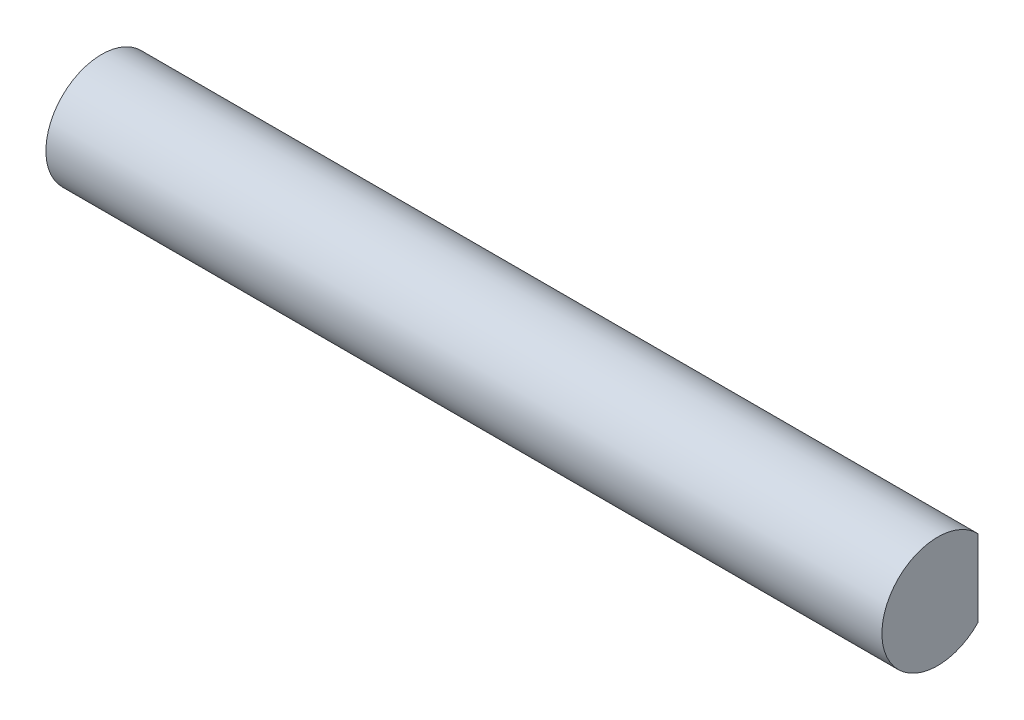
ISO-10303-21;
HEADER;
FILE_DESCRIPTION(('STEP AP214'),'2;1');
FILE_NAME('part.step','',(''),(''),'','','');
FILE_SCHEMA(('AUTOMOTIVE_DESIGN { 1 0 10303 214 1 1 1 1 }'));
ENDSEC;
DATA;
#1=APPLICATION_CONTEXT('core data for automotive mechanical design processes');
#2=APPLICATION_PROTOCOL_DEFINITION('international standard','automotive_design',2000,#1);
#3=PRODUCT_CONTEXT('',#1,'mechanical');
#4=PRODUCT('Part','Part','',(#3));
#5=PRODUCT_RELATED_PRODUCT_CATEGORY('part','',(#4));
#6=PRODUCT_DEFINITION_FORMATION('','',#4);
#7=PRODUCT_DEFINITION_CONTEXT('part definition',#1,'design');
#8=PRODUCT_DEFINITION('design','',#6,#7);
#9=PRODUCT_DEFINITION_SHAPE('','',#8);
#10=(LENGTH_UNIT() NAMED_UNIT(*) SI_UNIT(.MILLI.,.METRE.));
#11=(NAMED_UNIT(*) PLANE_ANGLE_UNIT() SI_UNIT($,.RADIAN.));
#12=(NAMED_UNIT(*) SI_UNIT($,.STERADIAN.) SOLID_ANGLE_UNIT());
#13=UNCERTAINTY_MEASURE_WITH_UNIT(LENGTH_MEASURE(1.E-05),#10,'distance_accuracy_value','');
#14=(GEOMETRIC_REPRESENTATION_CONTEXT(3) GLOBAL_UNCERTAINTY_ASSIGNED_CONTEXT((#13)) GLOBAL_UNIT_ASSIGNED_CONTEXT((#10,
#11,#12)) REPRESENTATION_CONTEXT('',''));
#15=CARTESIAN_POINT('',(0.,0.,0.));
#16=DIRECTION('',(0.,0.,1.));
#17=DIRECTION('',(1.,0.,0.));
#18=AXIS2_PLACEMENT_3D('',#15,#16,#17);
#19=CARTESIAN_POINT('',(-150.,7.73094010767585,1.00525588832597));
#20=DIRECTION('',(0.,0.866025403784436,0.500000000000004));
#21=DIRECTION('',(0.,-0.500000000000004,0.866025403784436));
#22=AXIS2_PLACEMENT_3D('',#19,#20,#21);
#23=PLANE('',#22);
#24=DIRECTION('',(0.,0.500000000000004,-0.866025403784436));
#25=VECTOR('',#24,1.);
#26=CARTESIAN_POINT('',(-0.799999999999995,7.73094010767585,1.00525588832597));
#27=LINE('',#26,#25);
#28=CARTESIAN_POINT('',(-0.799999999999995,5.482308546376,4.9000000000002));
#29=VERTEX_POINT('',#28);
#30=CARTESIAN_POINT('',(-0.799999999999995,7.73094010767585,1.00525588832597));
#31=VERTEX_POINT('',#30);
#32=EDGE_CURVE('E209',#29,#31,#27,.T.);
#33=ORIENTED_EDGE('',*,*,#32,.F.);
#34=DIRECTION('',(1.,0.,0.));
#35=VECTOR('',#34,1.);
#36=CARTESIAN_POINT('',(-150.,5.482308546376,4.9000000000002));
#37=LINE('',#36,#35);
#38=CARTESIAN_POINT('',(-145.,5.482308546376,4.9000000000002));
#39=VERTEX_POINT('',#38);
#40=EDGE_CURVE('E196',#39,#29,#37,.T.);
#41=ORIENTED_EDGE('',*,*,#40,.F.);
#42=DIRECTION('',(0.,-0.500000000000004,0.866025403784436));
#43=VECTOR('',#42,1.);
#44=CARTESIAN_POINT('',(-145.,7.73094010767585,1.00525588832597));
#45=LINE('',#44,#43);
#46=CARTESIAN_POINT('',(-145.,7.73094010767585,1.00525588832597));
#47=VERTEX_POINT('',#46);
#48=EDGE_CURVE('E206',#47,#39,#45,.T.);
#49=ORIENTED_EDGE('',*,*,#48,.F.);
#50=DIRECTION('',(1.,0.,0.));
#51=VECTOR('',#50,1.);
#52=CARTESIAN_POINT('',(-150.,7.73094010767585,1.00525588832597));
#53=LINE('',#52,#51);
#54=EDGE_CURVE('E210',#47,#31,#53,.T.);
#55=ORIENTED_EDGE('',*,*,#54,.T.);
#56=EDGE_LOOP('',(#33,#41,#49,#55));
#57=FACE_BOUND('',#56,.T.);
#58=ADVANCED_FACE('F33',(#57),#23,.F.);
#59=CARTESIAN_POINT('',(-150.,6.57320508075688,-0.999999999999804));
#60=DIRECTION('',(0.,0.86602540378444,-0.499999999999998));
#61=DIRECTION('',(0.,0.499999999999998,0.86602540378444));
#62=AXIS2_PLACEMENT_3D('',#59,#60,#61);
#63=PLANE('',#62);
#64=DIRECTION('',(0.,-0.499999999999998,-0.86602540378444));
#65=VECTOR('',#64,1.);
#66=CARTESIAN_POINT('',(-0.799999999999995,6.57320508075688,-0.999999999999804));
#67=LINE('',#66,#65);
#68=CARTESIAN_POINT('',(-0.799999999999995,6.57320508075688,-0.999999999999804));
#69=VERTEX_POINT('',#68);
#70=EDGE_CURVE('E48',#31,#69,#67,.T.);
#71=ORIENTED_EDGE('',*,*,#70,.F.);
#72=ORIENTED_EDGE('',*,*,#54,.F.);
#73=DIRECTION('',(0.,0.499999999999998,0.86602540378444));
#74=VECTOR('',#73,1.);
#75=CARTESIAN_POINT('',(-145.,6.57320508075688,-0.999999999999804));
#76=LINE('',#75,#74);
#77=CARTESIAN_POINT('',(-145.,6.57320508075688,-0.999999999999804));
#78=VERTEX_POINT('',#77);
#79=EDGE_CURVE('E349',#78,#47,#76,.T.);
#80=ORIENTED_EDGE('',*,*,#79,.F.);
#81=DIRECTION('',(1.,0.,0.));
#82=VECTOR('',#81,1.);
#83=CARTESIAN_POINT('',(-150.,6.57320508075688,-0.999999999999804));
#84=LINE('',#83,#82);
#85=EDGE_CURVE('E354',#78,#69,#84,.T.);
#86=ORIENTED_EDGE('',*,*,#85,.T.);
#87=EDGE_LOOP('',(#71,#72,#80,#86));
#88=FACE_BOUND('',#87,.T.);
#89=ADVANCED_FACE('F400',(#88),#63,.F.);
#90=CARTESIAN_POINT('',(-150.,-6.57320508075689,-0.999999999999804));
#91=DIRECTION('',(0.,0.,-1.));
#92=DIRECTION('',(-1.,0.,0.));
#93=AXIS2_PLACEMENT_3D('',#90,#91,#92);
#94=PLANE('',#93);
#95=DIRECTION('',(0.,1.,0.));
#96=VECTOR('',#95,1.);
#97=CARTESIAN_POINT('',(-50.5333333333333,-6.09999999999875,-0.999999999999805));
#98=LINE('',#97,#96);
#99=CARTESIAN_POINT('',(-50.5333333333333,-6.09999999999859,-0.999999999999801));
#100=VERTEX_POINT('',#99);
#101=CARTESIAN_POINT('',(-50.5333333333333,6.09999999999932,-0.999999999999801));
#102=VERTEX_POINT('',#101);
#103=EDGE_CURVE('E272',#100,#102,#98,.T.);
#104=ORIENTED_EDGE('',*,*,#103,.F.);
#105=DIRECTION('',(1.,0.,0.));
#106=VECTOR('',#105,1.);
#107=CARTESIAN_POINT('',(-50.5333333333333,-6.09999999999859,-0.999999999999805));
#108=LINE('',#107,#106);
#109=CARTESIAN_POINT('',(-99.4666666666668,-6.09999999999875,-0.999999999999805));
#110=VERTEX_POINT('',#109);
#111=EDGE_CURVE('E257',#110,#100,#108,.T.);
#112=ORIENTED_EDGE('',*,*,#111,.F.);
#113=DIRECTION('',(0.,-1.,0.));
#114=VECTOR('',#113,1.);
#115=CARTESIAN_POINT('',(-99.4666666666668,-6.09999999999875,-0.999999999999805));
#116=LINE('',#115,#114);
#117=CARTESIAN_POINT('',(-99.4666666666668,6.09999999999941,-0.999999999999804));
#118=VERTEX_POINT('',#117);
#119=EDGE_CURVE('E254',#118,#110,#116,.T.);
#120=ORIENTED_EDGE('',*,*,#119,.F.);
#121=DIRECTION('',(-1.,0.,0.));
#122=VECTOR('',#121,1.);
#123=CARTESIAN_POINT('',(-50.5333333333333,6.09999999999932,-0.999999999999805));
#124=LINE('',#123,#122);
#125=EDGE_CURVE('E253',#102,#118,#124,.T.);
#126=ORIENTED_EDGE('',*,*,#125,.F.);
#127=EDGE_LOOP('',(#104,#112,#120,#126));
#128=FACE_BOUND('',#127,.T.);
#129=DIRECTION('',(0.,-1.,0.));
#130=VECTOR('',#129,1.);
#131=CARTESIAN_POINT('',(-0.799999999999995,-6.57320508075689,-0.999999999999804));
#132=LINE('',#131,#130);
#133=CARTESIAN_POINT('',(-0.800000000000002,6.10000000000002,-0.999999999999801));
#134=VERTEX_POINT('',#133);
#135=EDGE_CURVE('E56',#69,#134,#132,.T.);
#136=ORIENTED_EDGE('',*,*,#135,.F.);
#137=ORIENTED_EDGE('',*,*,#85,.F.);
#138=DIRECTION('',(0.,1.,0.));
#139=VECTOR('',#138,1.);
#140=CARTESIAN_POINT('',(-145.,-6.57320508075689,-0.999999999999804));
#141=LINE('',#140,#139);
#142=CARTESIAN_POINT('',(-145.,6.09999999999988,-0.999999999999805));
#143=VERTEX_POINT('',#142);
#144=EDGE_CURVE('E345',#143,#78,#141,.T.);
#145=ORIENTED_EDGE('',*,*,#144,.F.);
#146=DIRECTION('',(-1.,0.,0.));
#147=VECTOR('',#146,1.);
#148=CARTESIAN_POINT('',(-100.266666666667,6.09999999999967,-0.999999999999805));
#149=LINE('',#148,#147);
#150=CARTESIAN_POINT('',(-100.266666666667,6.09999999999967,-0.999999999999801));
#151=VERTEX_POINT('',#150);
#152=EDGE_CURVE('E285',#151,#143,#149,.T.);
#153=ORIENTED_EDGE('',*,*,#152,.F.);
#154=DIRECTION('',(0.,1.,0.));
#155=VECTOR('',#154,1.);
#156=CARTESIAN_POINT('',(-100.266666666667,-6.0999999999984,-0.999999999999805));
#157=LINE('',#156,#155);
#158=CARTESIAN_POINT('',(-100.266666666667,-6.09999999999825,-0.999999999999801));
#159=VERTEX_POINT('',#158);
#160=EDGE_CURVE('E288',#159,#151,#157,.T.);
#161=ORIENTED_EDGE('',*,*,#160,.F.);
#162=DIRECTION('',(1.,0.,0.));
#163=VECTOR('',#162,1.);
#164=CARTESIAN_POINT('',(-100.266666666667,-6.09999999999825,-0.999999999999805));
#165=LINE('',#164,#163);
#166=CARTESIAN_POINT('',(-145.,-6.09999999999803,-0.999999999999805));
#167=VERTEX_POINT('',#166);
#168=EDGE_CURVE('E303',#167,#159,#165,.T.);
#169=ORIENTED_EDGE('',*,*,#168,.F.);
#170=CARTESIAN_POINT('',(-145.,-6.57320508075689,-0.999999999999804));
#171=VERTEX_POINT('',#170);
#172=EDGE_CURVE('E346',#171,#167,#141,.T.);
#173=ORIENTED_EDGE('',*,*,#172,.F.);
#174=DIRECTION('',(1.,0.,0.));
#175=VECTOR('',#174,1.);
#176=CARTESIAN_POINT('',(-150.,-6.57320508075689,-0.999999999999804));
#177=LINE('',#176,#175);
#178=CARTESIAN_POINT('',(-0.799999999999995,-6.57320508075689,-0.999999999999804));
#179=VERTEX_POINT('',#178);
#180=EDGE_CURVE('E356',#171,#179,#177,.T.);
#181=ORIENTED_EDGE('',*,*,#180,.T.);
#182=CARTESIAN_POINT('',(-0.800000000000003,-6.09999999999999,-0.999999999999805));
#183=VERTEX_POINT('',#182);
#184=EDGE_CURVE('E483',#183,#179,#132,.T.);
#185=ORIENTED_EDGE('',*,*,#184,.F.);
#186=DIRECTION('',(1.,0.,0.));
#187=VECTOR('',#186,1.);
#188=CARTESIAN_POINT('',(-0.800000000000003,-6.09999999999999,-0.999999999999805));
#189=LINE('',#188,#187);
#190=CARTESIAN_POINT('',(-49.7333333333334,-6.09999999999893,-0.999999999999804));
#191=VERTEX_POINT('',#190);
#192=EDGE_CURVE('E224',#191,#183,#189,.T.);
#193=ORIENTED_EDGE('',*,*,#192,.F.);
#194=DIRECTION('',(0.,-1.,0.));
#195=VECTOR('',#194,1.);
#196=CARTESIAN_POINT('',(-49.7333333333334,-6.09999999999909,-0.999999999999805));
#197=LINE('',#196,#195);
#198=CARTESIAN_POINT('',(-49.7333333333334,6.09999999999898,-0.999999999999801));
#199=VERTEX_POINT('',#198);
#200=EDGE_CURVE('E242',#199,#191,#197,.T.);
#201=ORIENTED_EDGE('',*,*,#200,.F.);
#202=DIRECTION('',(-1.,0.,0.));
#203=VECTOR('',#202,1.);
#204=CARTESIAN_POINT('',(-0.800000000000002,6.10000000000002,-0.999999999999805));
#205=LINE('',#204,#203);
#206=EDGE_CURVE('E227',#134,#199,#205,.T.);
#207=ORIENTED_EDGE('',*,*,#206,.F.);
#208=EDGE_LOOP('',(#136,#137,#145,#153,#161,#169,#173,#181,#185,#193,#201,#207));
#209=FACE_BOUND('',#208,.T.);
#210=ADVANCED_FACE('F404',(#128,#209),#94,.F.);
#211=CARTESIAN_POINT('',(-150.,-7.73094010767585,1.00525588832597));
#212=DIRECTION('',(0.,-0.86602540378444,-0.499999999999998));
#213=DIRECTION('',(0.,0.499999999999998,-0.86602540378444));
#214=AXIS2_PLACEMENT_3D('',#211,#212,#213);
#215=PLANE('',#214);
#216=DIRECTION('',(0.,-0.499999999999998,0.86602540378444));
#217=VECTOR('',#216,1.);
#218=CARTESIAN_POINT('',(-0.799999999999995,-7.73094010767585,1.00525588832597));
#219=LINE('',#218,#217);
#220=CARTESIAN_POINT('',(-0.799999999999995,-7.73094010767585,1.00525588832597));
#221=VERTEX_POINT('',#220);
#222=EDGE_CURVE('E219',#179,#221,#219,.T.);
#223=ORIENTED_EDGE('',*,*,#222,.F.);
#224=ORIENTED_EDGE('',*,*,#180,.F.);
#225=DIRECTION('',(0.,0.499999999999998,-0.86602540378444));
#226=VECTOR('',#225,1.);
#227=CARTESIAN_POINT('',(-145.,-7.73094010767585,1.00525588832597));
#228=LINE('',#227,#226);
#229=CARTESIAN_POINT('',(-145.,-7.73094010767585,1.00525588832597));
#230=VERTEX_POINT('',#229);
#231=EDGE_CURVE('E343',#230,#171,#228,.T.);
#232=ORIENTED_EDGE('',*,*,#231,.F.);
#233=DIRECTION('',(1.,0.,0.));
#234=VECTOR('',#233,1.);
#235=CARTESIAN_POINT('',(-150.,-7.73094010767585,1.00525588832597));
#236=LINE('',#235,#234);
#237=EDGE_CURVE('E359',#230,#221,#236,.T.);
#238=ORIENTED_EDGE('',*,*,#237,.T.);
#239=EDGE_LOOP('',(#223,#224,#232,#238));
#240=FACE_BOUND('',#239,.T.);
#241=ADVANCED_FACE('F412',(#240),#215,.F.);
#242=CARTESIAN_POINT('',(-150.,-5.48230854637601,4.9000000000002));
#243=DIRECTION('',(0.,-0.866025403784436,0.500000000000004));
#244=DIRECTION('',(0.,-0.500000000000004,-0.866025403784436));
#245=AXIS2_PLACEMENT_3D('',#242,#243,#244);
#246=PLANE('',#245);
#247=DIRECTION('',(0.,0.500000000000004,0.866025403784436));
#248=VECTOR('',#247,1.);
#249=CARTESIAN_POINT('',(-0.799999999999995,-5.48230854637601,4.9000000000002));
#250=LINE('',#249,#248);
#251=CARTESIAN_POINT('',(-0.799999999999995,-5.48230854637601,4.9000000000002));
#252=VERTEX_POINT('',#251);
#253=EDGE_CURVE('E217',#221,#252,#250,.T.);
#254=ORIENTED_EDGE('',*,*,#253,.F.);
#255=ORIENTED_EDGE('',*,*,#237,.F.);
#256=DIRECTION('',(0.,-0.500000000000004,-0.866025403784436));
#257=VECTOR('',#256,1.);
#258=CARTESIAN_POINT('',(-145.,-5.48230854637601,4.9000000000002));
#259=LINE('',#258,#257);
#260=CARTESIAN_POINT('',(-145.,-5.48230854637601,4.9000000000002));
#261=VERTEX_POINT('',#260);
#262=EDGE_CURVE('E339',#261,#230,#259,.T.);
#263=ORIENTED_EDGE('',*,*,#262,.F.);
#264=DIRECTION('',(1.,0.,0.));
#265=VECTOR('',#264,1.);
#266=CARTESIAN_POINT('',(-150.,-5.48230854637601,4.9000000000002));
#267=LINE('',#266,#265);
#268=EDGE_CURVE('E205',#261,#252,#267,.T.);
#269=ORIENTED_EDGE('',*,*,#268,.T.);
#270=EDGE_LOOP('',(#254,#255,#263,#269));
#271=FACE_BOUND('',#270,.T.);
#272=ADVANCED_FACE('F409',(#271),#246,.F.);
#273=CARTESIAN_POINT('',(-150.,5.482308546376,4.9000000000002));
#274=DIRECTION('',(0.,0.,1.));
#275=DIRECTION('',(1.,0.,0.));
#276=AXIS2_PLACEMENT_3D('',#273,#274,#275);
#277=PLANE('',#276);
#278=DIRECTION('',(0.,1.,0.));
#279=VECTOR('',#278,1.);
#280=CARTESIAN_POINT('',(-0.799999999999995,5.482308546376,4.9000000000002));
#281=LINE('',#280,#279);
#282=EDGE_CURVE('E201',#252,#29,#281,.T.);
#283=ORIENTED_EDGE('',*,*,#282,.F.);
#284=ORIENTED_EDGE('',*,*,#268,.F.);
#285=DIRECTION('',(0.,-1.,0.));
#286=VECTOR('',#285,1.);
#287=CARTESIAN_POINT('',(-145.,5.482308546376,4.9000000000002));
#288=LINE('',#287,#286);
#289=EDGE_CURVE('E11',#39,#261,#288,.T.);
#290=ORIENTED_EDGE('',*,*,#289,.F.);
#291=ORIENTED_EDGE('',*,*,#40,.T.);
#292=EDGE_LOOP('',(#283,#284,#290,#291));
#293=FACE_BOUND('',#292,.T.);
#294=ADVANCED_FACE('F198',(#293),#277,.F.);
#295=CARTESIAN_POINT('',(-150.,0.,1.95590071916385E-13));
#296=DIRECTION('',(1.,0.,0.));
#297=DIRECTION('',(0.,0.,-1.));
#298=AXIS2_PLACEMENT_3D('',#295,#296,#297);
#299=CYLINDRICAL_SURFACE('',#298,10.);
#300=CARTESIAN_POINT('',(0.,0.,1.95590071916385E-13));
#301=DIRECTION('',(1.,0.,0.));
#302=DIRECTION('',(0.,0.,-1.));
#303=AXIS2_PLACEMENT_3D('',#300,#301,#302);
#304=CIRCLE('',#303,10.);
#305=CARTESIAN_POINT('',(0.,6.9000000000001,-7.23809367167873));
#306=VERTEX_POINT('',#305);
#307=CARTESIAN_POINT('',(0.,-6.8999999999999,-7.23809367167893));
#308=VERTEX_POINT('',#307);
#309=EDGE_CURVE('E353',#306,#308,#304,.T.);
#310=ORIENTED_EDGE('',*,*,#309,.F.);
#311=DIRECTION('',(1.,0.,0.));
#312=VECTOR('',#311,1.);
#313=CARTESIAN_POINT('',(-150.,6.9000000000001,-7.23809367167873));
#314=LINE('',#313,#312);
#315=CARTESIAN_POINT('',(-150.,6.9000000000001,-7.23809367167873));
#316=VERTEX_POINT('',#315);
#317=EDGE_CURVE('E41',#316,#306,#314,.T.);
#318=ORIENTED_EDGE('',*,*,#317,.F.);
#319=CARTESIAN_POINT('',(-150.,0.,1.95590071916385E-13));
#320=DIRECTION('',(1.,0.,0.));
#321=DIRECTION('',(0.,0.,-1.));
#322=AXIS2_PLACEMENT_3D('',#319,#320,#321);
#323=CIRCLE('',#322,10.);
#324=CARTESIAN_POINT('',(-150.,-6.8999999999999,-7.23809367167893));
#325=VERTEX_POINT('',#324);
#326=EDGE_CURVE('E363',#316,#325,#323,.T.);
#327=ORIENTED_EDGE('',*,*,#326,.T.);
#328=DIRECTION('',(1.,0.,0.));
#329=VECTOR('',#328,1.);
#330=CARTESIAN_POINT('',(-150.,-6.8999999999999,-7.23809367167893));
#331=LINE('',#330,#329);
#332=EDGE_CURVE('E370',#325,#308,#331,.T.);
#333=ORIENTED_EDGE('',*,*,#332,.T.);
#334=EDGE_LOOP('',(#310,#318,#327,#333));
#335=FACE_BOUND('',#334,.T.);
#336=ADVANCED_FACE('F35',(#335),#299,.T.);
#337=CARTESIAN_POINT('',(-150.,-6.8999999999999,-7.23809367167893));
#338=DIRECTION('',(0.,0.,-1.));
#339=DIRECTION('',(0.,1.,0.));
#340=AXIS2_PLACEMENT_3D('',#337,#338,#339);
#341=PLANE('',#340);
#342=DIRECTION('',(0.,-1.,0.));
#343=VECTOR('',#342,1.);
#344=CARTESIAN_POINT('',(-0.800000000000003,-6.0999999999999,-7.23809367167892));
#345=LINE('',#344,#343);
#346=CARTESIAN_POINT('',(-0.800000000000002,6.10000000000011,-7.23809367167874));
#347=VERTEX_POINT('',#346);
#348=CARTESIAN_POINT('',(-0.799999999999995,-6.0999999999999,-7.23809367167892));
#349=VERTEX_POINT('',#348);
#350=EDGE_CURVE('E237',#347,#349,#345,.T.);
#351=ORIENTED_EDGE('',*,*,#350,.F.);
#352=DIRECTION('',(1.,0.,0.));
#353=VECTOR('',#352,1.);
#354=CARTESIAN_POINT('',(-0.800000000000002,6.10000000000011,-7.23809367167874));
#355=LINE('',#354,#353);
#356=CARTESIAN_POINT('',(-49.7333333333334,6.09999999999907,-7.23809367167874));
#357=VERTEX_POINT('',#356);
#358=EDGE_CURVE('E228',#357,#347,#355,.T.);
#359=ORIENTED_EDGE('',*,*,#358,.F.);
#360=DIRECTION('',(0.,1.,0.));
#361=VECTOR('',#360,1.);
#362=CARTESIAN_POINT('',(-49.7333333333334,-6.09999999999884,-7.23809367167892));
#363=LINE('',#362,#361);
#364=CARTESIAN_POINT('',(-49.7333333333334,-6.09999999999884,-7.23809367167892));
#365=VERTEX_POINT('',#364);
#366=EDGE_CURVE('E231',#365,#357,#363,.T.);
#367=ORIENTED_EDGE('',*,*,#366,.F.);
#368=DIRECTION('',(-1.,0.,0.));
#369=VECTOR('',#368,1.);
#370=CARTESIAN_POINT('',(-0.800000000000003,-6.0999999999999,-7.23809367167892));
#371=LINE('',#370,#369);
#372=EDGE_CURVE('E234',#349,#365,#371,.T.);
#373=ORIENTED_EDGE('',*,*,#372,.F.);
#374=EDGE_LOOP('',(#351,#359,#367,#373));
#375=FACE_BOUND('',#374,.T.);
#376=ORIENTED_EDGE('',*,*,#317,.T.);
#377=DIRECTION('',(0.,1.,0.));
#378=VECTOR('',#377,1.);
#379=CARTESIAN_POINT('',(0.,-6.8999999999999,-7.23809367167893));
#380=LINE('',#379,#378);
#381=EDGE_CURVE('E367',#308,#306,#380,.T.);
#382=ORIENTED_EDGE('',*,*,#381,.F.);
#383=ORIENTED_EDGE('',*,*,#332,.F.);
#384=DIRECTION('',(0.,1.,0.));
#385=VECTOR('',#384,1.);
#386=CARTESIAN_POINT('',(-150.,-6.8999999999999,-7.23809367167893));
#387=LINE('',#386,#385);
#388=EDGE_CURVE('E366',#325,#316,#387,.T.);
#389=ORIENTED_EDGE('',*,*,#388,.T.);
#390=EDGE_LOOP('',(#376,#382,#383,#389));
#391=FACE_BOUND('',#390,.T.);
#392=DIRECTION('',(-1.,0.,0.));
#393=VECTOR('',#392,1.);
#394=CARTESIAN_POINT('',(-50.5333333333333,-6.0999999999985,-7.23809367167892));
#395=LINE('',#394,#393);
#396=CARTESIAN_POINT('',(-50.5333333333333,-6.0999999999985,-7.23809367167892));
#397=VERTEX_POINT('',#396);
#398=CARTESIAN_POINT('',(-99.4666666666668,-6.09999999999859,-7.23809367167892));
#399=VERTEX_POINT('',#398);
#400=EDGE_CURVE('E267',#397,#399,#395,.T.);
#401=ORIENTED_EDGE('',*,*,#400,.F.);
#402=DIRECTION('',(0.,-1.,0.));
#403=VECTOR('',#402,1.);
#404=CARTESIAN_POINT('',(-50.5333333333333,-6.0999999999985,-7.23809367167892));
#405=LINE('',#404,#403);
#406=CARTESIAN_POINT('',(-50.5333333333333,6.09999999999941,-7.23809367167874));
#407=VERTEX_POINT('',#406);
#408=EDGE_CURVE('E258',#407,#397,#405,.T.);
#409=ORIENTED_EDGE('',*,*,#408,.F.);
#410=DIRECTION('',(1.,0.,0.));
#411=VECTOR('',#410,1.);
#412=CARTESIAN_POINT('',(-50.5333333333333,6.09999999999941,-7.23809367167874));
#413=LINE('',#412,#411);
#414=CARTESIAN_POINT('',(-99.4666666666668,6.09999999999941,-7.23809367167874));
#415=VERTEX_POINT('',#414);
#416=EDGE_CURVE('E261',#415,#407,#413,.T.);
#417=ORIENTED_EDGE('',*,*,#416,.F.);
#418=DIRECTION('',(0.,1.,0.));
#419=VECTOR('',#418,1.);
#420=CARTESIAN_POINT('',(-99.4666666666668,-6.0999999999985,-7.23809367167892));
#421=LINE('',#420,#419);
#422=EDGE_CURVE('E264',#399,#415,#421,.T.);
#423=ORIENTED_EDGE('',*,*,#422,.F.);
#424=EDGE_LOOP('',(#401,#409,#417,#423));
#425=FACE_BOUND('',#424,.T.);
#426=DIRECTION('',(0.,1.,0.));
#427=VECTOR('',#426,1.);
#428=CARTESIAN_POINT('',(-149.2,-6.09999999999792,-7.23809367167892));
#429=LINE('',#428,#427);
#430=CARTESIAN_POINT('',(-149.2,-6.09999999999792,-7.23809367167892));
#431=VERTEX_POINT('',#430);
#432=CARTESIAN_POINT('',(-149.2,6.09999999999999,-7.23809367167874));
#433=VERTEX_POINT('',#432);
#434=EDGE_CURVE('E298',#431,#433,#429,.T.);
#435=ORIENTED_EDGE('',*,*,#434,.F.);
#436=DIRECTION('',(-1.,0.,0.));
#437=VECTOR('',#436,1.);
#438=CARTESIAN_POINT('',(-100.266666666667,-6.09999999999816,-7.23809367167892));
#439=LINE('',#438,#437);
#440=CARTESIAN_POINT('',(-100.266666666667,-6.09999999999816,-7.23809367167892));
#441=VERTEX_POINT('',#440);
#442=EDGE_CURVE('E287',#441,#431,#439,.T.);
#443=ORIENTED_EDGE('',*,*,#442,.F.);
#444=DIRECTION('',(0.,-1.,0.));
#445=VECTOR('',#444,1.);
#446=CARTESIAN_POINT('',(-100.266666666667,-6.09999999999816,-7.23809367167892));
#447=LINE('',#446,#445);
#448=CARTESIAN_POINT('',(-100.266666666667,6.09999999999976,-7.23809367167874));
#449=VERTEX_POINT('',#448);
#450=EDGE_CURVE('E292',#449,#441,#447,.T.);
#451=ORIENTED_EDGE('',*,*,#450,.F.);
#452=DIRECTION('',(1.,0.,0.));
#453=VECTOR('',#452,1.);
#454=CARTESIAN_POINT('',(-100.266666666667,6.09999999999976,-7.23809367167874));
#455=LINE('',#454,#453);
#456=EDGE_CURVE('E295',#433,#449,#455,.T.);
#457=ORIENTED_EDGE('',*,*,#456,.F.);
#458=EDGE_LOOP('',(#435,#443,#451,#457));
#459=FACE_BOUND('',#458,.T.);
#460=ADVANCED_FACE('F383',(#375,#391,#425,#459),#341,.T.);
#461=CARTESIAN_POINT('',(-150.,0.,1.95590071916385E-13));
#462=DIRECTION('',(1.,0.,0.));
#463=DIRECTION('',(0.,0.,-1.));
#464=AXIS2_PLACEMENT_3D('',#461,#462,#463);
#465=PLANE('',#464);
#466=DIRECTION('',(0.,-1.,0.));
#467=VECTOR('',#466,1.);
#468=CARTESIAN_POINT('',(-150.,-6.4873867884811,-6.23809367167893));
#469=LINE('',#468,#467);
#470=CARTESIAN_POINT('',(-150.,6.48738678848111,-6.23809367167893));
#471=VERTEX_POINT('',#470);
#472=CARTESIAN_POINT('',(-150.,-6.4873867884811,-6.23809367167893));
#473=VERTEX_POINT('',#472);
#474=EDGE_CURVE('E329',#471,#473,#469,.T.);
#475=ORIENTED_EDGE('',*,*,#474,.F.);
#476=CARTESIAN_POINT('',(-150.,0.,0.));
#477=DIRECTION('',(-1.,0.,0.));
#478=DIRECTION('',(0.,0.,1.));
#479=AXIS2_PLACEMENT_3D('',#476,#477,#478);
#480=CIRCLE('',#479,9.);
#481=EDGE_CURVE('E244',#473,#471,#480,.T.);
#482=ORIENTED_EDGE('',*,*,#481,.F.);
#483=EDGE_LOOP('',(#475,#482));
#484=FACE_BOUND('',#483,.T.);
#485=ORIENTED_EDGE('',*,*,#326,.F.);
#486=ORIENTED_EDGE('',*,*,#388,.F.);
#487=EDGE_LOOP('',(#485,#486));
#488=FACE_BOUND('',#487,.T.);
#489=ADVANCED_FACE('F386',(#484,#488),#465,.F.);
#490=CARTESIAN_POINT('',(0.,0.,1.95590071916385E-13));
#491=DIRECTION('',(1.,0.,0.));
#492=DIRECTION('',(0.,0.,-1.));
#493=AXIS2_PLACEMENT_3D('',#490,#491,#492);
#494=PLANE('',#493);
#495=ORIENTED_EDGE('',*,*,#309,.T.);
#496=ORIENTED_EDGE('',*,*,#381,.T.);
#497=EDGE_LOOP('',(#495,#496));
#498=FACE_BOUND('',#497,.T.);
#499=ADVANCED_FACE('F382',(#498),#494,.T.);
#500=CARTESIAN_POINT('',(-145.,0.,0.));
#501=DIRECTION('',(-1.,0.,0.));
#502=DIRECTION('',(0.,0.,1.));
#503=AXIS2_PLACEMENT_3D('',#500,#501,#502);
#504=PLANE('',#503);
#505=DIRECTION('',(0.,0.,1.));
#506=VECTOR('',#505,1.);
#507=CARTESIAN_POINT('',(-145.,6.09999999999972,10.0010000000004));
#508=LINE('',#507,#506);
#509=CARTESIAN_POINT('',(-145.,6.09999999999995,-6.23809367167893));
#510=VERTEX_POINT('',#509);
#511=EDGE_CURVE('E312',#510,#143,#508,.T.);
#512=ORIENTED_EDGE('',*,*,#511,.T.);
#513=ORIENTED_EDGE('',*,*,#144,.T.);
#514=ORIENTED_EDGE('',*,*,#79,.T.);
#515=ORIENTED_EDGE('',*,*,#48,.T.);
#516=ORIENTED_EDGE('',*,*,#289,.T.);
#517=ORIENTED_EDGE('',*,*,#262,.T.);
#518=ORIENTED_EDGE('',*,*,#231,.T.);
#519=ORIENTED_EDGE('',*,*,#172,.T.);
#520=DIRECTION('',(0.,0.,-1.));
#521=VECTOR('',#520,1.);
#522=CARTESIAN_POINT('',(-145.,-6.09999999999819,10.0010000000002));
#523=LINE('',#522,#521);
#524=CARTESIAN_POINT('',(-145.,-6.09999999999796,-6.23809367167893));
#525=VERTEX_POINT('',#524);
#526=EDGE_CURVE('E319',#167,#525,#523,.T.);
#527=ORIENTED_EDGE('',*,*,#526,.T.);
#528=DIRECTION('',(0.,-1.,0.));
#529=VECTOR('',#528,1.);
#530=CARTESIAN_POINT('',(-145.,-6.4873867884811,-6.23809367167893));
#531=LINE('',#530,#529);
#532=CARTESIAN_POINT('',(-145.,-6.4873867884811,-6.23809367167893));
#533=VERTEX_POINT('',#532);
#534=EDGE_CURVE('E328',#525,#533,#531,.T.);
#535=ORIENTED_EDGE('',*,*,#534,.T.);
#536=CARTESIAN_POINT('',(-145.,0.,0.));
#537=DIRECTION('',(-1.,0.,0.));
#538=DIRECTION('',(0.,0.,1.));
#539=AXIS2_PLACEMENT_3D('',#536,#537,#538);
#540=CIRCLE('',#539,9.);
#541=CARTESIAN_POINT('',(-145.,6.48738678848111,-6.23809367167893));
#542=VERTEX_POINT('',#541);
#543=EDGE_CURVE('E325',#533,#542,#540,.T.);
#544=ORIENTED_EDGE('',*,*,#543,.T.);
#545=EDGE_CURVE('E330',#542,#510,#531,.T.);
#546=ORIENTED_EDGE('',*,*,#545,.T.);
#547=EDGE_LOOP('',(#512,#513,#514,#515,#516,#517,#518,#519,#527,#535,#544,#546));
#548=FACE_BOUND('',#547,.T.);
#549=ADVANCED_FACE('F394',(#548),#504,.T.);
#550=CARTESIAN_POINT('',(-145.,0.,0.));
#551=DIRECTION('',(-1.,0.,0.));
#552=DIRECTION('',(0.,0.,1.));
#553=AXIS2_PLACEMENT_3D('',#550,#551,#552);
#554=CYLINDRICAL_SURFACE('',#553,9.);
#555=ORIENTED_EDGE('',*,*,#481,.T.);
#556=DIRECTION('',(-1.,0.,0.));
#557=VECTOR('',#556,1.);
#558=CARTESIAN_POINT('',(-145.,6.48738678848111,-6.23809367167893));
#559=LINE('',#558,#557);
#560=EDGE_CURVE('E333',#542,#471,#559,.T.);
#561=ORIENTED_EDGE('',*,*,#560,.F.);
#562=ORIENTED_EDGE('',*,*,#543,.F.);
#563=DIRECTION('',(-1.,0.,0.));
#564=VECTOR('',#563,1.);
#565=CARTESIAN_POINT('',(-145.,-6.4873867884811,-6.23809367167893));
#566=LINE('',#565,#564);
#567=EDGE_CURVE('E337',#533,#473,#566,.T.);
#568=ORIENTED_EDGE('',*,*,#567,.T.);
#569=EDGE_LOOP('',(#555,#561,#562,#568));
#570=FACE_BOUND('',#569,.T.);
#571=ADVANCED_FACE('F420',(#570),#554,.F.);
#572=CARTESIAN_POINT('',(-145.,-6.4873867884811,-6.23809367167893));
#573=DIRECTION('',(0.,0.,-1.));
#574=DIRECTION('',(0.,1.,0.));
#575=AXIS2_PLACEMENT_3D('',#572,#573,#574);
#576=PLANE('',#575);
#577=DIRECTION('',(0.,-1.,0.));
#578=VECTOR('',#577,1.);
#579=CARTESIAN_POINT('',(-149.2,-6.09999999999818,-6.23809367167893));
#580=LINE('',#579,#578);
#581=CARTESIAN_POINT('',(-149.2,6.09999999999997,-6.23809367167892));
#582=VERTEX_POINT('',#581);
#583=CARTESIAN_POINT('',(-149.2,-6.09999999999794,-6.23809367167893));
#584=VERTEX_POINT('',#583);
#585=EDGE_CURVE('E289',#582,#584,#580,.T.);
#586=ORIENTED_EDGE('',*,*,#585,.F.);
#587=DIRECTION('',(-1.,0.,0.));
#588=VECTOR('',#587,1.);
#589=CARTESIAN_POINT('',(-100.266666666667,6.09999999999974,-6.23809367167893));
#590=LINE('',#589,#588);
#591=EDGE_CURVE('E306',#510,#582,#590,.T.);
#592=ORIENTED_EDGE('',*,*,#591,.F.);
#593=ORIENTED_EDGE('',*,*,#545,.F.);
#594=ORIENTED_EDGE('',*,*,#560,.T.);
#595=ORIENTED_EDGE('',*,*,#474,.T.);
#596=ORIENTED_EDGE('',*,*,#567,.F.);
#597=ORIENTED_EDGE('',*,*,#534,.F.);
#598=DIRECTION('',(1.,0.,0.));
#599=VECTOR('',#598,1.);
#600=CARTESIAN_POINT('',(-100.266666666667,-6.09999999999817,-6.23809367167893));
#601=LINE('',#600,#599);
#602=EDGE_CURVE('E291',#584,#525,#601,.T.);
#603=ORIENTED_EDGE('',*,*,#602,.F.);
#604=EDGE_LOOP('',(#586,#592,#593,#594,#595,#596,#597,#603));
#605=FACE_BOUND('',#604,.T.);
#606=ADVANCED_FACE('F423',(#605),#576,.F.);
#607=CARTESIAN_POINT('',(-149.2,-6.09999999999817,10.0010000000002));
#608=DIRECTION('',(-1.,0.,0.));
#609=DIRECTION('',(0.,0.,1.));
#610=AXIS2_PLACEMENT_3D('',#607,#608,#609);
#611=PLANE('',#610);
#612=ORIENTED_EDGE('',*,*,#585,.T.);
#613=DIRECTION('',(0.,0.,-1.));
#614=VECTOR('',#613,1.);
#615=CARTESIAN_POINT('',(-149.2,-6.09999999999817,10.0010000000002));
#616=LINE('',#615,#614);
#617=EDGE_CURVE('E284',#584,#431,#616,.T.);
#618=ORIENTED_EDGE('',*,*,#617,.T.);
#619=ORIENTED_EDGE('',*,*,#434,.T.);
#620=DIRECTION('',(0.,0.,-1.));
#621=VECTOR('',#620,1.);
#622=CARTESIAN_POINT('',(-149.2,6.09999999999974,10.0010000000004));
#623=LINE('',#622,#621);
#624=EDGE_CURVE('E294',#582,#433,#623,.T.);
#625=ORIENTED_EDGE('',*,*,#624,.F.);
#626=EDGE_LOOP('',(#612,#618,#619,#625));
#627=FACE_BOUND('',#626,.T.);
#628=ADVANCED_FACE('F427',(#627),#611,.F.);
#629=CARTESIAN_POINT('',(-100.266666666667,6.09999999999951,10.0010000000004));
#630=DIRECTION('',(0.,1.,0.));
#631=DIRECTION('',(0.,0.,1.));
#632=AXIS2_PLACEMENT_3D('',#629,#630,#631);
#633=PLANE('',#632);
#634=ORIENTED_EDGE('',*,*,#152,.T.);
#635=ORIENTED_EDGE('',*,*,#511,.F.);
#636=ORIENTED_EDGE('',*,*,#591,.T.);
#637=ORIENTED_EDGE('',*,*,#624,.T.);
#638=ORIENTED_EDGE('',*,*,#456,.T.);
#639=DIRECTION('',(0.,0.,-1.));
#640=VECTOR('',#639,1.);
#641=CARTESIAN_POINT('',(-100.266666666667,6.09999999999951,10.0010000000004));
#642=LINE('',#641,#640);
#643=EDGE_CURVE('E316',#151,#449,#642,.T.);
#644=ORIENTED_EDGE('',*,*,#643,.F.);
#645=EDGE_LOOP('',(#634,#635,#636,#637,#638,#644));
#646=FACE_BOUND('',#645,.T.);
#647=ADVANCED_FACE('F434',(#646),#633,.F.);
#648=CARTESIAN_POINT('',(-100.266666666667,-6.0999999999984,10.0010000000002));
#649=DIRECTION('',(1.,0.,0.));
#650=DIRECTION('',(0.,0.,-1.));
#651=AXIS2_PLACEMENT_3D('',#648,#649,#650);
#652=PLANE('',#651);
#653=ORIENTED_EDGE('',*,*,#160,.T.);
#654=ORIENTED_EDGE('',*,*,#643,.T.);
#655=ORIENTED_EDGE('',*,*,#450,.T.);
#656=DIRECTION('',(0.,0.,-1.));
#657=VECTOR('',#656,1.);
#658=CARTESIAN_POINT('',(-100.266666666667,-6.0999999999984,10.0010000000002));
#659=LINE('',#658,#657);
#660=EDGE_CURVE('E315',#159,#441,#659,.T.);
#661=ORIENTED_EDGE('',*,*,#660,.F.);
#662=EDGE_LOOP('',(#653,#654,#655,#661));
#663=FACE_BOUND('',#662,.T.);
#664=ADVANCED_FACE('F438',(#663),#652,.F.);
#665=CARTESIAN_POINT('',(-100.266666666667,-6.0999999999984,10.0010000000002));
#666=DIRECTION('',(0.,-1.,0.));
#667=DIRECTION('',(0.,0.,-1.));
#668=AXIS2_PLACEMENT_3D('',#665,#666,#667);
#669=PLANE('',#668);
#670=ORIENTED_EDGE('',*,*,#168,.T.);
#671=ORIENTED_EDGE('',*,*,#660,.T.);
#672=ORIENTED_EDGE('',*,*,#442,.T.);
#673=ORIENTED_EDGE('',*,*,#617,.F.);
#674=ORIENTED_EDGE('',*,*,#602,.T.);
#675=ORIENTED_EDGE('',*,*,#526,.F.);
#676=EDGE_LOOP('',(#670,#671,#672,#673,#674,#675));
#677=FACE_BOUND('',#676,.T.);
#678=ADVANCED_FACE('F442',(#677),#669,.F.);
#679=CARTESIAN_POINT('',(-50.5333333333333,-6.09999999999875,10.0010000000002));
#680=DIRECTION('',(0.,-1.,0.));
#681=DIRECTION('',(0.,0.,-1.));
#682=AXIS2_PLACEMENT_3D('',#679,#680,#681);
#683=PLANE('',#682);
#684=ORIENTED_EDGE('',*,*,#111,.T.);
#685=DIRECTION('',(0.,0.,-1.));
#686=VECTOR('',#685,1.);
#687=CARTESIAN_POINT('',(-50.5333333333333,-6.09999999999875,10.0010000000002));
#688=LINE('',#687,#686);
#689=EDGE_CURVE('E276',#100,#397,#688,.T.);
#690=ORIENTED_EDGE('',*,*,#689,.T.);
#691=ORIENTED_EDGE('',*,*,#400,.T.);
#692=DIRECTION('',(0.,0.,-1.));
#693=VECTOR('',#692,1.);
#694=CARTESIAN_POINT('',(-99.4666666666668,-6.09999999999875,10.0010000000002));
#695=LINE('',#694,#693);
#696=EDGE_CURVE('E279',#110,#399,#695,.T.);
#697=ORIENTED_EDGE('',*,*,#696,.F.);
#698=EDGE_LOOP('',(#684,#690,#691,#697));
#699=FACE_BOUND('',#698,.T.);
#700=ADVANCED_FACE('F446',(#699),#683,.F.);
#701=CARTESIAN_POINT('',(-50.5333333333333,-6.09999999999875,10.0010000000002));
#702=DIRECTION('',(1.,0.,0.));
#703=DIRECTION('',(0.,0.,-1.));
#704=AXIS2_PLACEMENT_3D('',#701,#702,#703);
#705=PLANE('',#704);
#706=ORIENTED_EDGE('',*,*,#103,.T.);
#707=DIRECTION('',(0.,0.,-1.));
#708=VECTOR('',#707,1.);
#709=CARTESIAN_POINT('',(-50.5333333333333,6.09999999999916,10.0010000000004));
#710=LINE('',#709,#708);
#711=EDGE_CURVE('E278',#102,#407,#710,.T.);
#712=ORIENTED_EDGE('',*,*,#711,.T.);
#713=ORIENTED_EDGE('',*,*,#408,.T.);
#714=ORIENTED_EDGE('',*,*,#689,.F.);
#715=EDGE_LOOP('',(#706,#712,#713,#714));
#716=FACE_BOUND('',#715,.T.);
#717=ADVANCED_FACE('F450',(#716),#705,.F.);
#718=CARTESIAN_POINT('',(-50.5333333333333,6.09999999999916,10.0010000000004));
#719=DIRECTION('',(0.,1.,0.));
#720=DIRECTION('',(0.,0.,1.));
#721=AXIS2_PLACEMENT_3D('',#718,#719,#720);
#722=PLANE('',#721);
#723=ORIENTED_EDGE('',*,*,#125,.T.);
#724=DIRECTION('',(0.,0.,-1.));
#725=VECTOR('',#724,1.);
#726=CARTESIAN_POINT('',(-99.4666666666668,6.09999999999917,10.0010000000004));
#727=LINE('',#726,#725);
#728=EDGE_CURVE('E269',#118,#415,#727,.T.);
#729=ORIENTED_EDGE('',*,*,#728,.T.);
#730=ORIENTED_EDGE('',*,*,#416,.T.);
#731=ORIENTED_EDGE('',*,*,#711,.F.);
#732=EDGE_LOOP('',(#723,#729,#730,#731));
#733=FACE_BOUND('',#732,.T.);
#734=ADVANCED_FACE('F454',(#733),#722,.F.);
#735=CARTESIAN_POINT('',(-99.4666666666668,-6.09999999999875,10.0010000000002));
#736=DIRECTION('',(-1.,0.,0.));
#737=DIRECTION('',(0.,0.,1.));
#738=AXIS2_PLACEMENT_3D('',#735,#736,#737);
#739=PLANE('',#738);
#740=ORIENTED_EDGE('',*,*,#119,.T.);
#741=ORIENTED_EDGE('',*,*,#696,.T.);
#742=ORIENTED_EDGE('',*,*,#422,.T.);
#743=ORIENTED_EDGE('',*,*,#728,.F.);
#744=EDGE_LOOP('',(#740,#741,#742,#743));
#745=FACE_BOUND('',#744,.T.);
#746=ADVANCED_FACE('F458',(#745),#739,.F.);
#747=CARTESIAN_POINT('',(-0.800000000000003,-6.10000000000014,10.0010000000002));
#748=DIRECTION('',(1.,0.,0.));
#749=DIRECTION('',(0.,1.,0.));
#750=AXIS2_PLACEMENT_3D('',#747,#748,#749);
#751=PLANE('',#750);
#752=DIRECTION('',(0.,0.,-1.));
#753=VECTOR('',#752,1.);
#754=CARTESIAN_POINT('',(-0.800000000000003,-6.10000000000014,10.0010000000002));
#755=LINE('',#754,#753);
#756=EDGE_CURVE('E248',#183,#349,#755,.T.);
#757=ORIENTED_EDGE('',*,*,#756,.F.);
#758=ORIENTED_EDGE('',*,*,#184,.T.);
#759=ORIENTED_EDGE('',*,*,#222,.T.);
#760=ORIENTED_EDGE('',*,*,#253,.T.);
#761=ORIENTED_EDGE('',*,*,#282,.T.);
#762=ORIENTED_EDGE('',*,*,#32,.T.);
#763=ORIENTED_EDGE('',*,*,#70,.T.);
#764=ORIENTED_EDGE('',*,*,#135,.T.);
#765=DIRECTION('',(0.,0.,-1.));
#766=VECTOR('',#765,1.);
#767=CARTESIAN_POINT('',(-0.800000000000002,6.09999999999986,10.0010000000004));
#768=LINE('',#767,#766);
#769=EDGE_CURVE('E245',#134,#347,#768,.T.);
#770=ORIENTED_EDGE('',*,*,#769,.T.);
#771=ORIENTED_EDGE('',*,*,#350,.T.);
#772=EDGE_LOOP('',(#757,#758,#759,#760,#761,#762,#763,#764,#770,#771));
#773=FACE_BOUND('',#772,.T.);
#774=ADVANCED_FACE('F215',(#773),#751,.F.);
#775=CARTESIAN_POINT('',(-0.800000000000002,6.09999999999986,10.0010000000004));
#776=DIRECTION('',(0.,1.,0.));
#777=DIRECTION('',(-1.,0.,0.));
#778=AXIS2_PLACEMENT_3D('',#775,#776,#777);
#779=PLANE('',#778);
#780=ORIENTED_EDGE('',*,*,#206,.T.);
#781=DIRECTION('',(0.,0.,-1.));
#782=VECTOR('',#781,1.);
#783=CARTESIAN_POINT('',(-49.7333333333334,6.09999999999882,10.0010000000004));
#784=LINE('',#783,#782);
#785=EDGE_CURVE('E247',#199,#357,#784,.T.);
#786=ORIENTED_EDGE('',*,*,#785,.T.);
#787=ORIENTED_EDGE('',*,*,#358,.T.);
#788=ORIENTED_EDGE('',*,*,#769,.F.);
#789=EDGE_LOOP('',(#780,#786,#787,#788));
#790=FACE_BOUND('',#789,.T.);
#791=ADVANCED_FACE('F465',(#790),#779,.F.);
#792=CARTESIAN_POINT('',(-49.7333333333334,-6.09999999999909,10.0010000000002));
#793=DIRECTION('',(-1.,0.,0.));
#794=DIRECTION('',(0.,0.,1.));
#795=AXIS2_PLACEMENT_3D('',#792,#793,#794);
#796=PLANE('',#795);
#797=ORIENTED_EDGE('',*,*,#200,.T.);
#798=DIRECTION('',(0.,0.,-1.));
#799=VECTOR('',#798,1.);
#800=CARTESIAN_POINT('',(-49.7333333333334,-6.09999999999909,10.0010000000002));
#801=LINE('',#800,#799);
#802=EDGE_CURVE('E239',#191,#365,#801,.T.);
#803=ORIENTED_EDGE('',*,*,#802,.T.);
#804=ORIENTED_EDGE('',*,*,#366,.T.);
#805=ORIENTED_EDGE('',*,*,#785,.F.);
#806=EDGE_LOOP('',(#797,#803,#804,#805));
#807=FACE_BOUND('',#806,.T.);
#808=ADVANCED_FACE('F468',(#807),#796,.F.);
#809=CARTESIAN_POINT('',(-0.800000000000003,-6.10000000000014,10.0010000000002));
#810=DIRECTION('',(0.,-1.,0.));
#811=DIRECTION('',(1.,0.,0.));
#812=AXIS2_PLACEMENT_3D('',#809,#810,#811);
#813=PLANE('',#812);
#814=ORIENTED_EDGE('',*,*,#192,.T.);
#815=ORIENTED_EDGE('',*,*,#756,.T.);
#816=ORIENTED_EDGE('',*,*,#372,.T.);
#817=ORIENTED_EDGE('',*,*,#802,.F.);
#818=EDGE_LOOP('',(#814,#815,#816,#817));
#819=FACE_BOUND('',#818,.T.);
#820=ADVANCED_FACE('F472',(#819),#813,.F.);
#821=CLOSED_SHELL('',(#58,#89,#210,#241,#272,#294,#336,#460,#489,#499,#549,#571,#606,#628,#647,
#664,#678,#700,#717,#734,#746,#774,#791,#808,#820));
#822=MANIFOLD_SOLID_BREP('B2',#821);
#823=ADVANCED_BREP_SHAPE_REPRESENTATION('',(#18,#822),#14);
#824=SHAPE_DEFINITION_REPRESENTATION(#9,#823);
ENDSEC;
END-ISO-10303-21;
